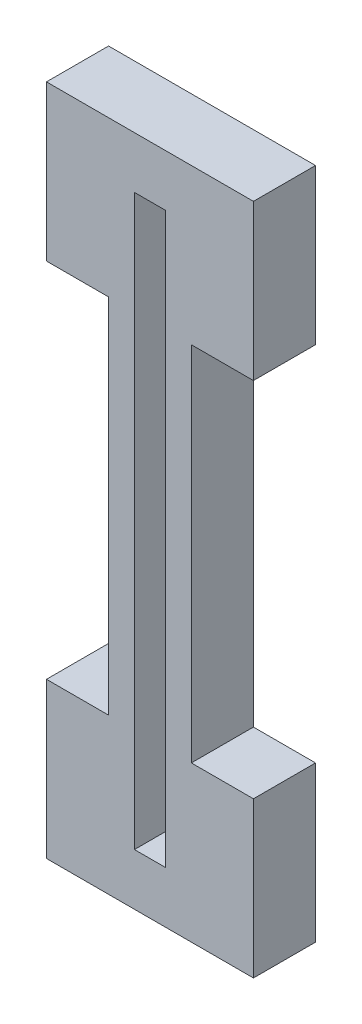
ISO-10303-21;
HEADER;
FILE_DESCRIPTION(('STEP AP214'),'2;1');
FILE_NAME('part.step','',(''),(''),'','','');
FILE_SCHEMA(('AUTOMOTIVE_DESIGN { 1 0 10303 214 1 1 1 1 }'));
ENDSEC;
DATA;
#1=APPLICATION_CONTEXT('core data for automotive mechanical design processes');
#2=APPLICATION_PROTOCOL_DEFINITION('international standard','automotive_design',2000,#1);
#3=PRODUCT_CONTEXT('',#1,'mechanical');
#4=PRODUCT('Part','Part','',(#3));
#5=PRODUCT_RELATED_PRODUCT_CATEGORY('part','',(#4));
#6=PRODUCT_DEFINITION_FORMATION('','',#4);
#7=PRODUCT_DEFINITION_CONTEXT('part definition',#1,'design');
#8=PRODUCT_DEFINITION('design','',#6,#7);
#9=PRODUCT_DEFINITION_SHAPE('','',#8);
#10=(LENGTH_UNIT() NAMED_UNIT(*) SI_UNIT(.MILLI.,.METRE.));
#11=(NAMED_UNIT(*) PLANE_ANGLE_UNIT() SI_UNIT($,.RADIAN.));
#12=(NAMED_UNIT(*) SI_UNIT($,.STERADIAN.) SOLID_ANGLE_UNIT());
#13=UNCERTAINTY_MEASURE_WITH_UNIT(LENGTH_MEASURE(1.E-05),#10,'distance_accuracy_value','');
#14=(GEOMETRIC_REPRESENTATION_CONTEXT(3) GLOBAL_UNCERTAINTY_ASSIGNED_CONTEXT((#13)) GLOBAL_UNIT_ASSIGNED_CONTEXT((#10,
#11,#12)) REPRESENTATION_CONTEXT('',''));
#15=CARTESIAN_POINT('',(0.,0.,0.));
#16=DIRECTION('',(0.,0.,1.));
#17=DIRECTION('',(1.,0.,0.));
#18=AXIS2_PLACEMENT_3D('',#15,#16,#17);
#19=CARTESIAN_POINT('',(0.,0.,6.));
#20=DIRECTION('',(0.,0.,-1.));
#21=DIRECTION('',(-1.,0.,0.));
#22=AXIS2_PLACEMENT_3D('',#19,#20,#21);
#23=PLANE('',#22);
#24=DIRECTION('',(0.,-1.,0.));
#25=VECTOR('',#24,1.);
#26=CARTESIAN_POINT('',(0.,0.,6.));
#27=LINE('',#26,#25);
#28=CARTESIAN_POINT('',(0.,15.,6.));
#29=VERTEX_POINT('',#28);
#30=CARTESIAN_POINT('',(0.,0.,6.));
#31=VERTEX_POINT('',#30);
#32=EDGE_CURVE('E220',#29,#31,#27,.T.);
#33=ORIENTED_EDGE('',*,*,#32,.T.);
#34=DIRECTION('',(1.,0.,0.));
#35=VECTOR('',#34,1.);
#36=CARTESIAN_POINT('',(0.,0.,6.));
#37=LINE('',#36,#35);
#38=CARTESIAN_POINT('',(20.,0.,6.));
#39=VERTEX_POINT('',#38);
#40=EDGE_CURVE('E328',#31,#39,#37,.T.);
#41=ORIENTED_EDGE('',*,*,#40,.T.);
#42=DIRECTION('',(0.,1.,0.));
#43=VECTOR('',#42,1.);
#44=CARTESIAN_POINT('',(20.,0.,6.));
#45=LINE('',#44,#43);
#46=CARTESIAN_POINT('',(20.,15.,6.));
#47=VERTEX_POINT('',#46);
#48=EDGE_CURVE('E256',#39,#47,#45,.T.);
#49=ORIENTED_EDGE('',*,*,#48,.T.);
#50=DIRECTION('',(-1.,0.,0.));
#51=VECTOR('',#50,1.);
#52=CARTESIAN_POINT('',(20.,15.,6.));
#53=LINE('',#52,#51);
#54=CARTESIAN_POINT('',(14.,15.,6.));
#55=VERTEX_POINT('',#54);
#56=EDGE_CURVE('E278',#47,#55,#53,.T.);
#57=ORIENTED_EDGE('',*,*,#56,.T.);
#58=DIRECTION('',(0.,1.,0.));
#59=VECTOR('',#58,1.);
#60=CARTESIAN_POINT('',(14.,50.,6.));
#61=LINE('',#60,#59);
#62=CARTESIAN_POINT('',(14.,50.,6.));
#63=VERTEX_POINT('',#62);
#64=EDGE_CURVE('E273',#55,#63,#61,.T.);
#65=ORIENTED_EDGE('',*,*,#64,.T.);
#66=DIRECTION('',(1.,0.,0.));
#67=VECTOR('',#66,1.);
#68=CARTESIAN_POINT('',(20.,50.,6.));
#69=LINE('',#68,#67);
#70=CARTESIAN_POINT('',(20.,50.,6.));
#71=VERTEX_POINT('',#70);
#72=EDGE_CURVE('E277',#63,#71,#69,.T.);
#73=ORIENTED_EDGE('',*,*,#72,.T.);
#74=DIRECTION('',(0.,1.,0.));
#75=VECTOR('',#74,1.);
#76=CARTESIAN_POINT('',(20.,50.,6.));
#77=LINE('',#76,#75);
#78=CARTESIAN_POINT('',(20.,65.,6.));
#79=VERTEX_POINT('',#78);
#80=EDGE_CURVE('E282',#71,#79,#77,.T.);
#81=ORIENTED_EDGE('',*,*,#80,.T.);
#82=DIRECTION('',(-1.,0.,0.));
#83=VECTOR('',#82,1.);
#84=CARTESIAN_POINT('',(0.,65.,6.));
#85=LINE('',#84,#83);
#86=CARTESIAN_POINT('',(0.,65.,6.));
#87=VERTEX_POINT('',#86);
#88=EDGE_CURVE('E300',#79,#87,#85,.T.);
#89=ORIENTED_EDGE('',*,*,#88,.T.);
#90=DIRECTION('',(0.,-1.,0.));
#91=VECTOR('',#90,1.);
#92=CARTESIAN_POINT('',(0.,50.,6.));
#93=LINE('',#92,#91);
#94=CARTESIAN_POINT('',(0.,50.,6.));
#95=VERTEX_POINT('',#94);
#96=EDGE_CURVE('E304',#87,#95,#93,.T.);
#97=ORIENTED_EDGE('',*,*,#96,.T.);
#98=DIRECTION('',(1.,0.,0.));
#99=VECTOR('',#98,1.);
#100=CARTESIAN_POINT('',(0.,50.,6.));
#101=LINE('',#100,#99);
#102=CARTESIAN_POINT('',(5.99999999999999,50.,6.));
#103=VERTEX_POINT('',#102);
#104=EDGE_CURVE('E307',#95,#103,#101,.T.);
#105=ORIENTED_EDGE('',*,*,#104,.T.);
#106=DIRECTION('',(0.,-1.,0.));
#107=VECTOR('',#106,1.);
#108=CARTESIAN_POINT('',(5.99999999999999,50.,6.));
#109=LINE('',#108,#107);
#110=CARTESIAN_POINT('',(6.,15.,6.));
#111=VERTEX_POINT('',#110);
#112=EDGE_CURVE('E193',#103,#111,#109,.T.);
#113=ORIENTED_EDGE('',*,*,#112,.T.);
#114=DIRECTION('',(-1.,0.,0.));
#115=VECTOR('',#114,1.);
#116=CARTESIAN_POINT('',(0.,15.,6.));
#117=LINE('',#116,#115);
#118=EDGE_CURVE('E188',#111,#29,#117,.T.);
#119=ORIENTED_EDGE('',*,*,#118,.T.);
#120=EDGE_LOOP('',(#33,#41,#49,#57,#65,#73,#81,#89,#97,#105,#113,#119));
#121=FACE_BOUND('',#120,.T.);
#122=DIRECTION('',(0.,-1.,0.));
#123=VECTOR('',#122,1.);
#124=CARTESIAN_POINT('',(8.49999999999999,60.,6.));
#125=LINE('',#124,#123);
#126=CARTESIAN_POINT('',(8.49999999999999,60.,6.));
#127=VERTEX_POINT('',#126);
#128=CARTESIAN_POINT('',(8.5,5.,6.));
#129=VERTEX_POINT('',#128);
#130=EDGE_CURVE('E149',#127,#129,#125,.T.);
#131=ORIENTED_EDGE('',*,*,#130,.F.);
#132=DIRECTION('',(-1.,0.,0.));
#133=VECTOR('',#132,1.);
#134=CARTESIAN_POINT('',(8.49999999999999,60.,6.));
#135=LINE('',#134,#133);
#136=CARTESIAN_POINT('',(11.5,60.,6.));
#137=VERTEX_POINT('',#136);
#138=EDGE_CURVE('E173',#137,#127,#135,.T.);
#139=ORIENTED_EDGE('',*,*,#138,.F.);
#140=DIRECTION('',(0.,1.,0.));
#141=VECTOR('',#140,1.);
#142=CARTESIAN_POINT('',(11.5,60.,6.));
#143=LINE('',#142,#141);
#144=CARTESIAN_POINT('',(11.5,5.,6.));
#145=VERTEX_POINT('',#144);
#146=EDGE_CURVE('E170',#145,#137,#143,.T.);
#147=ORIENTED_EDGE('',*,*,#146,.F.);
#148=DIRECTION('',(1.,0.,0.));
#149=VECTOR('',#148,1.);
#150=CARTESIAN_POINT('',(8.5,5.,6.));
#151=LINE('',#150,#149);
#152=EDGE_CURVE('E158',#129,#145,#151,.T.);
#153=ORIENTED_EDGE('',*,*,#152,.F.);
#154=EDGE_LOOP('',(#131,#139,#147,#153));
#155=FACE_BOUND('',#154,.T.);
#156=ADVANCED_FACE('F36',(#121,#155),#23,.F.);
#157=CARTESIAN_POINT('',(0.,0.,0.));
#158=DIRECTION('',(0.,0.,-1.));
#159=DIRECTION('',(-1.,0.,0.));
#160=AXIS2_PLACEMENT_3D('',#157,#158,#159);
#161=PLANE('',#160);
#162=DIRECTION('',(0.,-1.,0.));
#163=VECTOR('',#162,1.);
#164=CARTESIAN_POINT('',(0.,0.,0.));
#165=LINE('',#164,#163);
#166=CARTESIAN_POINT('',(0.,15.,0.));
#167=VERTEX_POINT('',#166);
#168=CARTESIAN_POINT('',(0.,0.,0.));
#169=VERTEX_POINT('',#168);
#170=EDGE_CURVE('E166',#167,#169,#165,.T.);
#171=ORIENTED_EDGE('',*,*,#170,.F.);
#172=DIRECTION('',(-1.,0.,0.));
#173=VECTOR('',#172,1.);
#174=CARTESIAN_POINT('',(0.,15.,0.));
#175=LINE('',#174,#173);
#176=CARTESIAN_POINT('',(6.,15.,0.));
#177=VERTEX_POINT('',#176);
#178=EDGE_CURVE('E218',#177,#167,#175,.T.);
#179=ORIENTED_EDGE('',*,*,#178,.F.);
#180=DIRECTION('',(0.,-1.,0.));
#181=VECTOR('',#180,1.);
#182=CARTESIAN_POINT('',(5.99999999999999,50.,0.));
#183=LINE('',#182,#181);
#184=CARTESIAN_POINT('',(5.99999999999999,50.,0.));
#185=VERTEX_POINT('',#184);
#186=EDGE_CURVE('E216',#185,#177,#183,.T.);
#187=ORIENTED_EDGE('',*,*,#186,.F.);
#188=DIRECTION('',(1.,0.,0.));
#189=VECTOR('',#188,1.);
#190=CARTESIAN_POINT('',(0.,50.,0.));
#191=LINE('',#190,#189);
#192=CARTESIAN_POINT('',(0.,50.,0.));
#193=VERTEX_POINT('',#192);
#194=EDGE_CURVE('E214',#193,#185,#191,.T.);
#195=ORIENTED_EDGE('',*,*,#194,.F.);
#196=DIRECTION('',(0.,-1.,0.));
#197=VECTOR('',#196,1.);
#198=CARTESIAN_POINT('',(0.,50.,0.));
#199=LINE('',#198,#197);
#200=CARTESIAN_POINT('',(0.,65.,0.));
#201=VERTEX_POINT('',#200);
#202=EDGE_CURVE('E212',#201,#193,#199,.T.);
#203=ORIENTED_EDGE('',*,*,#202,.F.);
#204=DIRECTION('',(-1.,0.,0.));
#205=VECTOR('',#204,1.);
#206=CARTESIAN_POINT('',(0.,65.,0.));
#207=LINE('',#206,#205);
#208=CARTESIAN_POINT('',(20.,65.,0.));
#209=VERTEX_POINT('',#208);
#210=EDGE_CURVE('E210',#209,#201,#207,.T.);
#211=ORIENTED_EDGE('',*,*,#210,.F.);
#212=DIRECTION('',(0.,1.,0.));
#213=VECTOR('',#212,1.);
#214=CARTESIAN_POINT('',(20.,50.,0.));
#215=LINE('',#214,#213);
#216=CARTESIAN_POINT('',(20.,50.,0.));
#217=VERTEX_POINT('',#216);
#218=EDGE_CURVE('E208',#217,#209,#215,.T.);
#219=ORIENTED_EDGE('',*,*,#218,.F.);
#220=DIRECTION('',(1.,0.,0.));
#221=VECTOR('',#220,1.);
#222=CARTESIAN_POINT('',(20.,50.,0.));
#223=LINE('',#222,#221);
#224=CARTESIAN_POINT('',(14.,50.,0.));
#225=VERTEX_POINT('',#224);
#226=EDGE_CURVE('E206',#225,#217,#223,.T.);
#227=ORIENTED_EDGE('',*,*,#226,.F.);
#228=DIRECTION('',(0.,1.,0.));
#229=VECTOR('',#228,1.);
#230=CARTESIAN_POINT('',(14.,50.,0.));
#231=LINE('',#230,#229);
#232=CARTESIAN_POINT('',(14.,15.,0.));
#233=VERTEX_POINT('',#232);
#234=EDGE_CURVE('E204',#233,#225,#231,.T.);
#235=ORIENTED_EDGE('',*,*,#234,.F.);
#236=DIRECTION('',(-1.,0.,0.));
#237=VECTOR('',#236,1.);
#238=CARTESIAN_POINT('',(20.,15.,0.));
#239=LINE('',#238,#237);
#240=CARTESIAN_POINT('',(20.,15.,0.));
#241=VERTEX_POINT('',#240);
#242=EDGE_CURVE('E202',#241,#233,#239,.T.);
#243=ORIENTED_EDGE('',*,*,#242,.F.);
#244=DIRECTION('',(0.,1.,0.));
#245=VECTOR('',#244,1.);
#246=CARTESIAN_POINT('',(20.,0.,0.));
#247=LINE('',#246,#245);
#248=CARTESIAN_POINT('',(20.,0.,0.));
#249=VERTEX_POINT('',#248);
#250=EDGE_CURVE('E200',#249,#241,#247,.T.);
#251=ORIENTED_EDGE('',*,*,#250,.F.);
#252=DIRECTION('',(1.,0.,0.));
#253=VECTOR('',#252,1.);
#254=CARTESIAN_POINT('',(0.,0.,0.));
#255=LINE('',#254,#253);
#256=EDGE_CURVE('E198',#169,#249,#255,.T.);
#257=ORIENTED_EDGE('',*,*,#256,.F.);
#258=EDGE_LOOP('',(#171,#179,#187,#195,#203,#211,#219,#227,#235,#243,#251,#257));
#259=FACE_BOUND('',#258,.T.);
#260=DIRECTION('',(-1.,0.,0.));
#261=VECTOR('',#260,1.);
#262=CARTESIAN_POINT('',(8.49999999999999,60.,0.));
#263=LINE('',#262,#261);
#264=CARTESIAN_POINT('',(11.5,60.,0.));
#265=VERTEX_POINT('',#264);
#266=CARTESIAN_POINT('',(8.49999999999999,60.,0.));
#267=VERTEX_POINT('',#266);
#268=EDGE_CURVE('E159',#265,#267,#263,.T.);
#269=ORIENTED_EDGE('',*,*,#268,.T.);
#270=DIRECTION('',(0.,-1.,0.));
#271=VECTOR('',#270,1.);
#272=CARTESIAN_POINT('',(8.49999999999999,60.,0.));
#273=LINE('',#272,#271);
#274=CARTESIAN_POINT('',(8.5,5.,0.));
#275=VERTEX_POINT('',#274);
#276=EDGE_CURVE('E59',#267,#275,#273,.T.);
#277=ORIENTED_EDGE('',*,*,#276,.T.);
#278=DIRECTION('',(1.,0.,0.));
#279=VECTOR('',#278,1.);
#280=CARTESIAN_POINT('',(8.5,5.,0.));
#281=LINE('',#280,#279);
#282=CARTESIAN_POINT('',(11.5,5.,0.));
#283=VERTEX_POINT('',#282);
#284=EDGE_CURVE('E165',#275,#283,#281,.T.);
#285=ORIENTED_EDGE('',*,*,#284,.T.);
#286=DIRECTION('',(0.,1.,0.));
#287=VECTOR('',#286,1.);
#288=CARTESIAN_POINT('',(11.5,60.,0.));
#289=LINE('',#288,#287);
#290=EDGE_CURVE('E508',#283,#265,#289,.T.);
#291=ORIENTED_EDGE('',*,*,#290,.T.);
#292=EDGE_LOOP('',(#269,#277,#285,#291));
#293=FACE_BOUND('',#292,.T.);
#294=ADVANCED_FACE('F261',(#259,#293),#161,.T.);
#295=CARTESIAN_POINT('',(0.,0.,6.));
#296=DIRECTION('',(1.,0.,0.));
#297=DIRECTION('',(0.,0.,-1.));
#298=AXIS2_PLACEMENT_3D('',#295,#296,#297);
#299=PLANE('',#298);
#300=ORIENTED_EDGE('',*,*,#170,.T.);
#301=DIRECTION('',(0.,0.,-1.));
#302=VECTOR('',#301,1.);
#303=CARTESIAN_POINT('',(0.,0.,6.));
#304=LINE('',#303,#302);
#305=EDGE_CURVE('E12',#31,#169,#304,.T.);
#306=ORIENTED_EDGE('',*,*,#305,.F.);
#307=ORIENTED_EDGE('',*,*,#32,.F.);
#308=DIRECTION('',(0.,0.,-1.));
#309=VECTOR('',#308,1.);
#310=CARTESIAN_POINT('',(0.,15.,6.));
#311=LINE('',#310,#309);
#312=EDGE_CURVE('E192',#29,#167,#311,.T.);
#313=ORIENTED_EDGE('',*,*,#312,.T.);
#314=EDGE_LOOP('',(#300,#306,#307,#313));
#315=FACE_BOUND('',#314,.T.);
#316=ADVANCED_FACE('F38',(#315),#299,.F.);
#317=CARTESIAN_POINT('',(0.,0.,6.));
#318=DIRECTION('',(0.,1.,0.));
#319=DIRECTION('',(-1.,0.,0.));
#320=AXIS2_PLACEMENT_3D('',#317,#318,#319);
#321=PLANE('',#320);
#322=ORIENTED_EDGE('',*,*,#256,.T.);
#323=DIRECTION('',(0.,0.,-1.));
#324=VECTOR('',#323,1.);
#325=CARTESIAN_POINT('',(20.,0.,6.));
#326=LINE('',#325,#324);
#327=EDGE_CURVE('E44',#39,#249,#326,.T.);
#328=ORIENTED_EDGE('',*,*,#327,.F.);
#329=ORIENTED_EDGE('',*,*,#40,.F.);
#330=ORIENTED_EDGE('',*,*,#305,.T.);
#331=EDGE_LOOP('',(#322,#328,#329,#330));
#332=FACE_BOUND('',#331,.T.);
#333=ADVANCED_FACE('F339',(#332),#321,.F.);
#334=CARTESIAN_POINT('',(20.,0.,6.));
#335=DIRECTION('',(-1.,0.,0.));
#336=DIRECTION('',(0.,0.,1.));
#337=AXIS2_PLACEMENT_3D('',#334,#335,#336);
#338=PLANE('',#337);
#339=ORIENTED_EDGE('',*,*,#250,.T.);
#340=DIRECTION('',(0.,0.,-1.));
#341=VECTOR('',#340,1.);
#342=CARTESIAN_POINT('',(20.,15.,6.));
#343=LINE('',#342,#341);
#344=EDGE_CURVE('E247',#47,#241,#343,.T.);
#345=ORIENTED_EDGE('',*,*,#344,.F.);
#346=ORIENTED_EDGE('',*,*,#48,.F.);
#347=ORIENTED_EDGE('',*,*,#327,.T.);
#348=EDGE_LOOP('',(#339,#345,#346,#347));
#349=FACE_BOUND('',#348,.T.);
#350=ADVANCED_FACE('F254',(#349),#338,.F.);
#351=CARTESIAN_POINT('',(20.,15.,6.));
#352=DIRECTION('',(0.,-1.,0.));
#353=DIRECTION('',(0.,0.,-1.));
#354=AXIS2_PLACEMENT_3D('',#351,#352,#353);
#355=PLANE('',#354);
#356=ORIENTED_EDGE('',*,*,#242,.T.);
#357=DIRECTION('',(0.,0.,-1.));
#358=VECTOR('',#357,1.);
#359=CARTESIAN_POINT('',(14.,15.,6.));
#360=LINE('',#359,#358);
#361=EDGE_CURVE('E244',#55,#233,#360,.T.);
#362=ORIENTED_EDGE('',*,*,#361,.F.);
#363=ORIENTED_EDGE('',*,*,#56,.F.);
#364=ORIENTED_EDGE('',*,*,#344,.T.);
#365=EDGE_LOOP('',(#356,#362,#363,#364));
#366=FACE_BOUND('',#365,.T.);
#367=ADVANCED_FACE('F267',(#366),#355,.F.);
#368=CARTESIAN_POINT('',(14.,50.,6.));
#369=DIRECTION('',(-1.,0.,0.));
#370=DIRECTION('',(0.,-1.,0.));
#371=AXIS2_PLACEMENT_3D('',#368,#369,#370);
#372=PLANE('',#371);
#373=ORIENTED_EDGE('',*,*,#234,.T.);
#374=DIRECTION('',(0.,0.,-1.));
#375=VECTOR('',#374,1.);
#376=CARTESIAN_POINT('',(14.,50.,6.));
#377=LINE('',#376,#375);
#378=EDGE_CURVE('E241',#63,#225,#377,.T.);
#379=ORIENTED_EDGE('',*,*,#378,.F.);
#380=ORIENTED_EDGE('',*,*,#64,.F.);
#381=ORIENTED_EDGE('',*,*,#361,.T.);
#382=EDGE_LOOP('',(#373,#379,#380,#381));
#383=FACE_BOUND('',#382,.T.);
#384=ADVANCED_FACE('F271',(#383),#372,.F.);
#385=CARTESIAN_POINT('',(20.,50.,6.));
#386=DIRECTION('',(0.,1.,0.));
#387=DIRECTION('',(0.,0.,1.));
#388=AXIS2_PLACEMENT_3D('',#385,#386,#387);
#389=PLANE('',#388);
#390=ORIENTED_EDGE('',*,*,#226,.T.);
#391=DIRECTION('',(0.,0.,-1.));
#392=VECTOR('',#391,1.);
#393=CARTESIAN_POINT('',(20.,50.,6.));
#394=LINE('',#393,#392);
#395=EDGE_CURVE('E238',#71,#217,#394,.T.);
#396=ORIENTED_EDGE('',*,*,#395,.F.);
#397=ORIENTED_EDGE('',*,*,#72,.F.);
#398=ORIENTED_EDGE('',*,*,#378,.T.);
#399=EDGE_LOOP('',(#390,#396,#397,#398));
#400=FACE_BOUND('',#399,.T.);
#401=ADVANCED_FACE('F360',(#400),#389,.F.);
#402=CARTESIAN_POINT('',(20.,50.,6.));
#403=DIRECTION('',(-1.,0.,0.));
#404=DIRECTION('',(0.,-1.,0.));
#405=AXIS2_PLACEMENT_3D('',#402,#403,#404);
#406=PLANE('',#405);
#407=ORIENTED_EDGE('',*,*,#218,.T.);
#408=DIRECTION('',(0.,0.,-1.));
#409=VECTOR('',#408,1.);
#410=CARTESIAN_POINT('',(20.,65.,6.));
#411=LINE('',#410,#409);
#412=EDGE_CURVE('E235',#79,#209,#411,.T.);
#413=ORIENTED_EDGE('',*,*,#412,.F.);
#414=ORIENTED_EDGE('',*,*,#80,.F.);
#415=ORIENTED_EDGE('',*,*,#395,.T.);
#416=EDGE_LOOP('',(#407,#413,#414,#415));
#417=FACE_BOUND('',#416,.T.);
#418=ADVANCED_FACE('F356',(#417),#406,.F.);
#419=CARTESIAN_POINT('',(0.,65.,6.));
#420=DIRECTION('',(0.,-1.,0.));
#421=DIRECTION('',(0.,0.,-1.));
#422=AXIS2_PLACEMENT_3D('',#419,#420,#421);
#423=PLANE('',#422);
#424=ORIENTED_EDGE('',*,*,#210,.T.);
#425=DIRECTION('',(0.,0.,-1.));
#426=VECTOR('',#425,1.);
#427=CARTESIAN_POINT('',(0.,65.,6.));
#428=LINE('',#427,#426);
#429=EDGE_CURVE('E232',#87,#201,#428,.T.);
#430=ORIENTED_EDGE('',*,*,#429,.F.);
#431=ORIENTED_EDGE('',*,*,#88,.F.);
#432=ORIENTED_EDGE('',*,*,#412,.T.);
#433=EDGE_LOOP('',(#424,#430,#431,#432));
#434=FACE_BOUND('',#433,.T.);
#435=ADVANCED_FACE('F352',(#434),#423,.F.);
#436=CARTESIAN_POINT('',(0.,50.,6.));
#437=DIRECTION('',(1.,0.,0.));
#438=DIRECTION('',(0.,1.,0.));
#439=AXIS2_PLACEMENT_3D('',#436,#437,#438);
#440=PLANE('',#439);
#441=ORIENTED_EDGE('',*,*,#202,.T.);
#442=DIRECTION('',(0.,0.,-1.));
#443=VECTOR('',#442,1.);
#444=CARTESIAN_POINT('',(0.,50.,6.));
#445=LINE('',#444,#443);
#446=EDGE_CURVE('E229',#95,#193,#445,.T.);
#447=ORIENTED_EDGE('',*,*,#446,.F.);
#448=ORIENTED_EDGE('',*,*,#96,.F.);
#449=ORIENTED_EDGE('',*,*,#429,.T.);
#450=EDGE_LOOP('',(#441,#447,#448,#449));
#451=FACE_BOUND('',#450,.T.);
#452=ADVANCED_FACE('F348',(#451),#440,.F.);
#453=CARTESIAN_POINT('',(0.,50.,6.));
#454=DIRECTION('',(0.,1.,0.));
#455=DIRECTION('',(0.,0.,1.));
#456=AXIS2_PLACEMENT_3D('',#453,#454,#455);
#457=PLANE('',#456);
#458=ORIENTED_EDGE('',*,*,#194,.T.);
#459=DIRECTION('',(0.,0.,-1.));
#460=VECTOR('',#459,1.);
#461=CARTESIAN_POINT('',(5.99999999999999,50.,6.));
#462=LINE('',#461,#460);
#463=EDGE_CURVE('E226',#103,#185,#462,.T.);
#464=ORIENTED_EDGE('',*,*,#463,.F.);
#465=ORIENTED_EDGE('',*,*,#104,.F.);
#466=ORIENTED_EDGE('',*,*,#446,.T.);
#467=EDGE_LOOP('',(#458,#464,#465,#466));
#468=FACE_BOUND('',#467,.T.);
#469=ADVANCED_FACE('F344',(#468),#457,.F.);
#470=CARTESIAN_POINT('',(5.99999999999999,50.,6.));
#471=DIRECTION('',(1.,0.,0.));
#472=DIRECTION('',(0.,1.,0.));
#473=AXIS2_PLACEMENT_3D('',#470,#471,#472);
#474=PLANE('',#473);
#475=ORIENTED_EDGE('',*,*,#186,.T.);
#476=DIRECTION('',(0.,0.,-1.));
#477=VECTOR('',#476,1.);
#478=CARTESIAN_POINT('',(6.,15.,6.));
#479=LINE('',#478,#477);
#480=EDGE_CURVE('E223',#111,#177,#479,.T.);
#481=ORIENTED_EDGE('',*,*,#480,.F.);
#482=ORIENTED_EDGE('',*,*,#112,.F.);
#483=ORIENTED_EDGE('',*,*,#463,.T.);
#484=EDGE_LOOP('',(#475,#481,#482,#483));
#485=FACE_BOUND('',#484,.T.);
#486=ADVANCED_FACE('F319',(#485),#474,.F.);
#487=CARTESIAN_POINT('',(0.,15.,6.));
#488=DIRECTION('',(0.,-1.,0.));
#489=DIRECTION('',(0.,0.,-1.));
#490=AXIS2_PLACEMENT_3D('',#487,#488,#489);
#491=PLANE('',#490);
#492=ORIENTED_EDGE('',*,*,#178,.T.);
#493=ORIENTED_EDGE('',*,*,#312,.F.);
#494=ORIENTED_EDGE('',*,*,#118,.F.);
#495=ORIENTED_EDGE('',*,*,#480,.T.);
#496=EDGE_LOOP('',(#492,#493,#494,#495));
#497=FACE_BOUND('',#496,.T.);
#498=ADVANCED_FACE('F323',(#497),#491,.F.);
#499=CARTESIAN_POINT('',(8.49999999999999,60.,6.));
#500=DIRECTION('',(1.,0.,0.));
#501=DIRECTION('',(0.,1.,0.));
#502=AXIS2_PLACEMENT_3D('',#499,#500,#501);
#503=PLANE('',#502);
#504=ORIENTED_EDGE('',*,*,#276,.F.);
#505=DIRECTION('',(0.,0.,-1.));
#506=VECTOR('',#505,1.);
#507=CARTESIAN_POINT('',(8.49999999999999,60.,6.));
#508=LINE('',#507,#506);
#509=EDGE_CURVE('E153',#127,#267,#508,.T.);
#510=ORIENTED_EDGE('',*,*,#509,.F.);
#511=ORIENTED_EDGE('',*,*,#130,.T.);
#512=DIRECTION('',(0.,0.,-1.));
#513=VECTOR('',#512,1.);
#514=CARTESIAN_POINT('',(8.5,5.,6.));
#515=LINE('',#514,#513);
#516=EDGE_CURVE('E152',#129,#275,#515,.T.);
#517=ORIENTED_EDGE('',*,*,#516,.T.);
#518=EDGE_LOOP('',(#504,#510,#511,#517));
#519=FACE_BOUND('',#518,.T.);
#520=ADVANCED_FACE('F151',(#519),#503,.T.);
#521=CARTESIAN_POINT('',(8.5,5.,6.));
#522=DIRECTION('',(0.,1.,0.));
#523=DIRECTION('',(0.,0.,1.));
#524=AXIS2_PLACEMENT_3D('',#521,#522,#523);
#525=PLANE('',#524);
#526=ORIENTED_EDGE('',*,*,#284,.F.);
#527=ORIENTED_EDGE('',*,*,#516,.F.);
#528=ORIENTED_EDGE('',*,*,#152,.T.);
#529=DIRECTION('',(0.,0.,-1.));
#530=VECTOR('',#529,1.);
#531=CARTESIAN_POINT('',(11.5,5.,6.));
#532=LINE('',#531,#530);
#533=EDGE_CURVE('E167',#145,#283,#532,.T.);
#534=ORIENTED_EDGE('',*,*,#533,.T.);
#535=EDGE_LOOP('',(#526,#527,#528,#534));
#536=FACE_BOUND('',#535,.T.);
#537=ADVANCED_FACE('F162',(#536),#525,.T.);
#538=CARTESIAN_POINT('',(11.5,60.,6.));
#539=DIRECTION('',(-1.,0.,0.));
#540=DIRECTION('',(0.,-1.,0.));
#541=AXIS2_PLACEMENT_3D('',#538,#539,#540);
#542=PLANE('',#541);
#543=ORIENTED_EDGE('',*,*,#290,.F.);
#544=ORIENTED_EDGE('',*,*,#533,.F.);
#545=ORIENTED_EDGE('',*,*,#146,.T.);
#546=DIRECTION('',(0.,0.,-1.));
#547=VECTOR('',#546,1.);
#548=CARTESIAN_POINT('',(11.5,60.,6.));
#549=LINE('',#548,#547);
#550=EDGE_CURVE('E51',#137,#265,#549,.T.);
#551=ORIENTED_EDGE('',*,*,#550,.T.);
#552=EDGE_LOOP('',(#543,#544,#545,#551));
#553=FACE_BOUND('',#552,.T.);
#554=ADVANCED_FACE('F418',(#553),#542,.T.);
#555=CARTESIAN_POINT('',(8.49999999999999,60.,6.));
#556=DIRECTION('',(0.,-1.,0.));
#557=DIRECTION('',(0.,0.,-1.));
#558=AXIS2_PLACEMENT_3D('',#555,#556,#557);
#559=PLANE('',#558);
#560=ORIENTED_EDGE('',*,*,#268,.F.);
#561=ORIENTED_EDGE('',*,*,#550,.F.);
#562=ORIENTED_EDGE('',*,*,#138,.T.);
#563=ORIENTED_EDGE('',*,*,#509,.T.);
#564=EDGE_LOOP('',(#560,#561,#562,#563));
#565=FACE_BOUND('',#564,.T.);
#566=ADVANCED_FACE('F424',(#565),#559,.T.);
#567=CLOSED_SHELL('',(#156,#294,#316,#333,#350,#367,#384,#401,#418,#435,#452,#469,#486,#498,
#520,#537,#554,#566));
#568=MANIFOLD_SOLID_BREP('B2',#567);
#569=ADVANCED_BREP_SHAPE_REPRESENTATION('',(#18,#568),#14);
#570=SHAPE_DEFINITION_REPRESENTATION(#9,#569);
ENDSEC;
END-ISO-10303-21;
